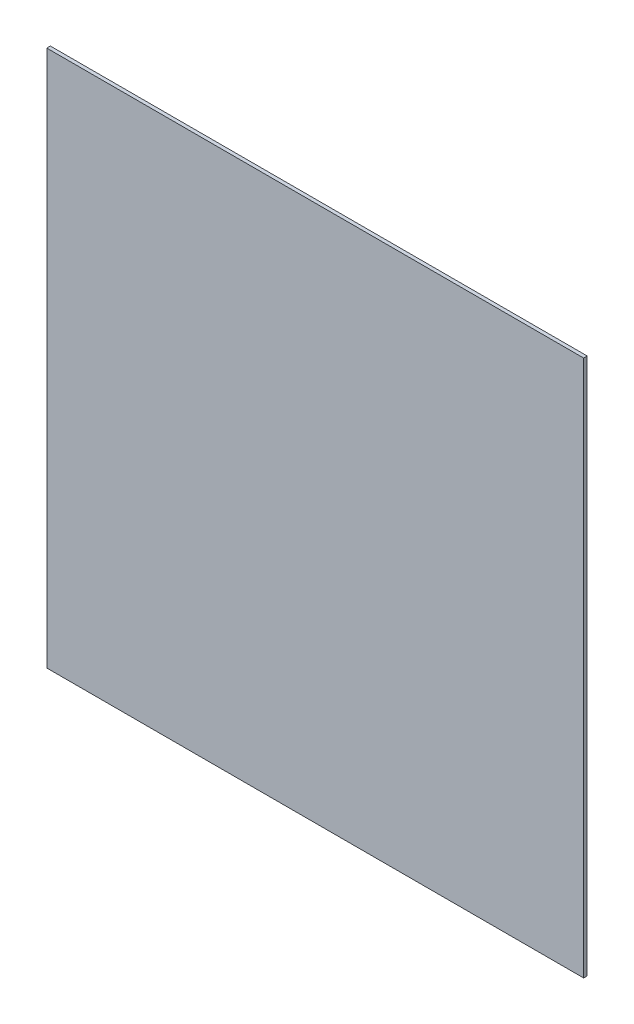
ISO-10303-21;
HEADER;
FILE_DESCRIPTION(('STEP AP214'),'2;1');
FILE_NAME('part.step','',(''),(''),'','','');
FILE_SCHEMA(('AUTOMOTIVE_DESIGN { 1 0 10303 214 1 1 1 1 }'));
ENDSEC;
DATA;
#1=APPLICATION_CONTEXT('core data for automotive mechanical design processes');
#2=APPLICATION_PROTOCOL_DEFINITION('international standard','automotive_design',2000,#1);
#3=PRODUCT_CONTEXT('',#1,'mechanical');
#4=PRODUCT('Part','Part','',(#3));
#5=PRODUCT_RELATED_PRODUCT_CATEGORY('part','',(#4));
#6=PRODUCT_DEFINITION_FORMATION('','',#4);
#7=PRODUCT_DEFINITION_CONTEXT('part definition',#1,'design');
#8=PRODUCT_DEFINITION('design','',#6,#7);
#9=PRODUCT_DEFINITION_SHAPE('','',#8);
#10=(LENGTH_UNIT() NAMED_UNIT(*) SI_UNIT(.MILLI.,.METRE.));
#11=(NAMED_UNIT(*) PLANE_ANGLE_UNIT() SI_UNIT($,.RADIAN.));
#12=(NAMED_UNIT(*) SI_UNIT($,.STERADIAN.) SOLID_ANGLE_UNIT());
#13=UNCERTAINTY_MEASURE_WITH_UNIT(LENGTH_MEASURE(1.E-05),#10,'distance_accuracy_value','');
#14=(GEOMETRIC_REPRESENTATION_CONTEXT(3) GLOBAL_UNCERTAINTY_ASSIGNED_CONTEXT((#13)) GLOBAL_UNIT_ASSIGNED_CONTEXT((#10,
#11,#12)) REPRESENTATION_CONTEXT('',''));
#15=CARTESIAN_POINT('',(0.,0.,0.));
#16=DIRECTION('',(0.,0.,1.));
#17=DIRECTION('',(1.,0.,0.));
#18=AXIS2_PLACEMENT_3D('',#15,#16,#17);
#19=CARTESIAN_POINT('',(-284.009637128581,207.967576253428,3.));
#20=DIRECTION('',(1.,0.,0.));
#21=DIRECTION('',(0.,0.,-1.));
#22=AXIS2_PLACEMENT_3D('',#19,#20,#21);
#23=PLANE('',#22);
#24=DIRECTION('',(0.,-1.,0.));
#25=VECTOR('',#24,1.);
#26=CARTESIAN_POINT('',(-284.009637128581,207.967576253428,0.));
#27=LINE('',#26,#25);
#28=CARTESIAN_POINT('',(-284.009637128581,207.967576253428,0.));
#29=VERTEX_POINT('',#28);
#30=CARTESIAN_POINT('',(-284.009637128581,-242.032423746572,0.));
#31=VERTEX_POINT('',#30);
#32=EDGE_CURVE('E97',#29,#31,#27,.T.);
#33=ORIENTED_EDGE('',*,*,#32,.T.);
#34=DIRECTION('',(0.,0.,-1.));
#35=VECTOR('',#34,1.);
#36=CARTESIAN_POINT('',(-284.009637128581,-242.032423746572,3.));
#37=LINE('',#36,#35);
#38=CARTESIAN_POINT('',(-284.009637128581,-242.032423746572,3.));
#39=VERTEX_POINT('',#38);
#40=EDGE_CURVE('E11',#39,#31,#37,.T.);
#41=ORIENTED_EDGE('',*,*,#40,.F.);
#42=DIRECTION('',(0.,-1.,0.));
#43=VECTOR('',#42,1.);
#44=CARTESIAN_POINT('',(-284.009637128581,207.967576253428,3.));
#45=LINE('',#44,#43);
#46=CARTESIAN_POINT('',(-284.009637128581,207.967576253428,3.));
#47=VERTEX_POINT('',#46);
#48=EDGE_CURVE('E85',#47,#39,#45,.T.);
#49=ORIENTED_EDGE('',*,*,#48,.F.);
#50=DIRECTION('',(0.,0.,-1.));
#51=VECTOR('',#50,1.);
#52=CARTESIAN_POINT('',(-284.009637128581,207.967576253428,3.));
#53=LINE('',#52,#51);
#54=EDGE_CURVE('E93',#47,#29,#53,.T.);
#55=ORIENTED_EDGE('',*,*,#54,.T.);
#56=EDGE_LOOP('',(#33,#41,#49,#55));
#57=FACE_BOUND('',#56,.T.);
#58=ADVANCED_FACE('F34',(#57),#23,.F.);
#59=CARTESIAN_POINT('',(-284.009637128581,-242.032423746572,3.));
#60=DIRECTION('',(0.,1.,0.));
#61=DIRECTION('',(0.,0.,1.));
#62=AXIS2_PLACEMENT_3D('',#59,#60,#61);
#63=PLANE('',#62);
#64=DIRECTION('',(1.,0.,0.));
#65=VECTOR('',#64,1.);
#66=CARTESIAN_POINT('',(-284.009637128581,-242.032423746572,0.));
#67=LINE('',#66,#65);
#68=CARTESIAN_POINT('',(165.990362871419,-242.032423746572,0.));
#69=VERTEX_POINT('',#68);
#70=EDGE_CURVE('E89',#31,#69,#67,.T.);
#71=ORIENTED_EDGE('',*,*,#70,.T.);
#72=DIRECTION('',(0.,0.,-1.));
#73=VECTOR('',#72,1.);
#74=CARTESIAN_POINT('',(165.990362871419,-242.032423746572,3.));
#75=LINE('',#74,#73);
#76=CARTESIAN_POINT('',(165.990362871419,-242.032423746572,3.));
#77=VERTEX_POINT('',#76);
#78=EDGE_CURVE('E42',#77,#69,#75,.T.);
#79=ORIENTED_EDGE('',*,*,#78,.F.);
#80=DIRECTION('',(1.,0.,0.));
#81=VECTOR('',#80,1.);
#82=CARTESIAN_POINT('',(-284.009637128581,-242.032423746572,3.));
#83=LINE('',#82,#81);
#84=EDGE_CURVE('E80',#39,#77,#83,.T.);
#85=ORIENTED_EDGE('',*,*,#84,.F.);
#86=ORIENTED_EDGE('',*,*,#40,.T.);
#87=EDGE_LOOP('',(#71,#79,#85,#86));
#88=FACE_BOUND('',#87,.T.);
#89=ADVANCED_FACE('F88',(#88),#63,.F.);
#90=CARTESIAN_POINT('',(165.990362871419,207.967576253428,3.));
#91=DIRECTION('',(-1.,0.,0.));
#92=DIRECTION('',(0.,-1.,0.));
#93=AXIS2_PLACEMENT_3D('',#90,#91,#92);
#94=PLANE('',#93);
#95=DIRECTION('',(0.,1.,0.));
#96=VECTOR('',#95,1.);
#97=CARTESIAN_POINT('',(165.990362871419,207.967576253428,0.));
#98=LINE('',#97,#96);
#99=CARTESIAN_POINT('',(165.990362871419,207.967576253428,0.));
#100=VERTEX_POINT('',#99);
#101=EDGE_CURVE('E67',#69,#100,#98,.T.);
#102=ORIENTED_EDGE('',*,*,#101,.T.);
#103=DIRECTION('',(0.,0.,-1.));
#104=VECTOR('',#103,1.);
#105=CARTESIAN_POINT('',(165.990362871419,207.967576253428,3.));
#106=LINE('',#105,#104);
#107=CARTESIAN_POINT('',(165.990362871419,207.967576253428,3.));
#108=VERTEX_POINT('',#107);
#109=EDGE_CURVE('E90',#108,#100,#106,.T.);
#110=ORIENTED_EDGE('',*,*,#109,.F.);
#111=DIRECTION('',(0.,1.,0.));
#112=VECTOR('',#111,1.);
#113=CARTESIAN_POINT('',(165.990362871419,207.967576253428,3.));
#114=LINE('',#113,#112);
#115=EDGE_CURVE('E83',#77,#108,#114,.T.);
#116=ORIENTED_EDGE('',*,*,#115,.F.);
#117=ORIENTED_EDGE('',*,*,#78,.T.);
#118=EDGE_LOOP('',(#102,#110,#116,#117));
#119=FACE_BOUND('',#118,.T.);
#120=ADVANCED_FACE('F91',(#119),#94,.F.);
#121=CARTESIAN_POINT('',(-284.009637128581,207.967576253428,3.));
#122=DIRECTION('',(0.,-1.,0.));
#123=DIRECTION('',(0.,0.,-1.));
#124=AXIS2_PLACEMENT_3D('',#121,#122,#123);
#125=PLANE('',#124);
#126=DIRECTION('',(-1.,0.,0.));
#127=VECTOR('',#126,1.);
#128=CARTESIAN_POINT('',(-284.009637128581,207.967576253428,0.));
#129=LINE('',#128,#127);
#130=EDGE_CURVE('E73',#100,#29,#129,.T.);
#131=ORIENTED_EDGE('',*,*,#130,.T.);
#132=ORIENTED_EDGE('',*,*,#54,.F.);
#133=DIRECTION('',(-1.,0.,0.));
#134=VECTOR('',#133,1.);
#135=CARTESIAN_POINT('',(-284.009637128581,207.967576253428,3.));
#136=LINE('',#135,#134);
#137=EDGE_CURVE('E50',#108,#47,#136,.T.);
#138=ORIENTED_EDGE('',*,*,#137,.F.);
#139=ORIENTED_EDGE('',*,*,#109,.T.);
#140=EDGE_LOOP('',(#131,#132,#138,#139));
#141=FACE_BOUND('',#140,.T.);
#142=ADVANCED_FACE('F104',(#141),#125,.F.);
#143=CARTESIAN_POINT('',(0.,0.,3.));
#144=DIRECTION('',(0.,0.,1.));
#145=DIRECTION('',(1.,0.,0.));
#146=AXIS2_PLACEMENT_3D('',#143,#144,#145);
#147=PLANE('',#146);
#148=ORIENTED_EDGE('',*,*,#48,.T.);
#149=ORIENTED_EDGE('',*,*,#84,.T.);
#150=ORIENTED_EDGE('',*,*,#115,.T.);
#151=ORIENTED_EDGE('',*,*,#137,.T.);
#152=EDGE_LOOP('',(#148,#149,#150,#151));
#153=FACE_BOUND('',#152,.T.);
#154=ADVANCED_FACE('F81',(#153),#147,.T.);
#155=CARTESIAN_POINT('',(0.,0.,0.));
#156=DIRECTION('',(0.,0.,1.));
#157=DIRECTION('',(1.,0.,0.));
#158=AXIS2_PLACEMENT_3D('',#155,#156,#157);
#159=PLANE('',#158);
#160=ORIENTED_EDGE('',*,*,#32,.F.);
#161=ORIENTED_EDGE('',*,*,#130,.F.);
#162=ORIENTED_EDGE('',*,*,#101,.F.);
#163=ORIENTED_EDGE('',*,*,#70,.F.);
#164=EDGE_LOOP('',(#160,#161,#162,#163));
#165=FACE_BOUND('',#164,.T.);
#166=ADVANCED_FACE('F107',(#165),#159,.F.);
#167=CLOSED_SHELL('',(#58,#89,#120,#142,#154,#166));
#168=MANIFOLD_SOLID_BREP('B2',#167);
#169=ADVANCED_BREP_SHAPE_REPRESENTATION('',(#18,#168),#14);
#170=SHAPE_DEFINITION_REPRESENTATION(#9,#169);
ENDSEC;
END-ISO-10303-21;
